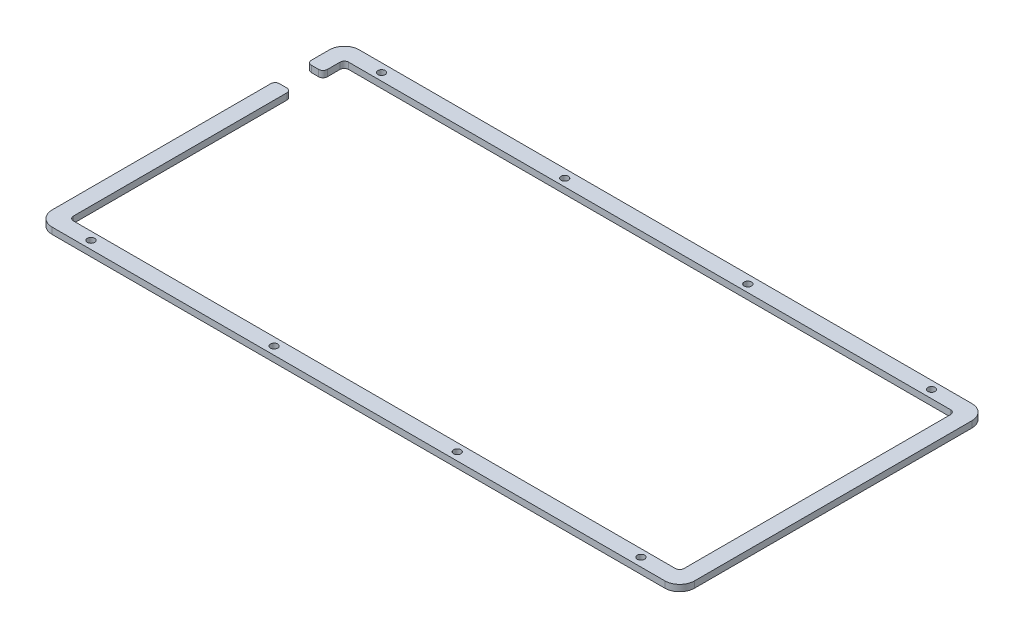
ISO-10303-21;
HEADER;
FILE_DESCRIPTION(('STEP AP214'),'2;1');
FILE_NAME('part.step','',(''),(''),'','','');
FILE_SCHEMA(('AUTOMOTIVE_DESIGN { 1 0 10303 214 1 1 1 1 }'));
ENDSEC;
DATA;
#1=APPLICATION_CONTEXT('core data for automotive mechanical design processes');
#2=APPLICATION_PROTOCOL_DEFINITION('international standard','automotive_design',2000,#1);
#3=PRODUCT_CONTEXT('',#1,'mechanical');
#4=PRODUCT('Part','Part','',(#3));
#5=PRODUCT_RELATED_PRODUCT_CATEGORY('part','',(#4));
#6=PRODUCT_DEFINITION_FORMATION('','',#4);
#7=PRODUCT_DEFINITION_CONTEXT('part definition',#1,'design');
#8=PRODUCT_DEFINITION('design','',#6,#7);
#9=PRODUCT_DEFINITION_SHAPE('','',#8);
#10=(LENGTH_UNIT() NAMED_UNIT(*) SI_UNIT(.MILLI.,.METRE.));
#11=(NAMED_UNIT(*) PLANE_ANGLE_UNIT() SI_UNIT($,.RADIAN.));
#12=(NAMED_UNIT(*) SI_UNIT($,.STERADIAN.) SOLID_ANGLE_UNIT());
#13=UNCERTAINTY_MEASURE_WITH_UNIT(LENGTH_MEASURE(1.E-05),#10,'distance_accuracy_value','');
#14=(GEOMETRIC_REPRESENTATION_CONTEXT(3) GLOBAL_UNCERTAINTY_ASSIGNED_CONTEXT((#13)) GLOBAL_UNIT_ASSIGNED_CONTEXT((#10,
#11,#12)) REPRESENTATION_CONTEXT('',''));
#15=CARTESIAN_POINT('',(0.,0.,0.));
#16=DIRECTION('',(0.,0.,1.));
#17=DIRECTION('',(1.,0.,0.));
#18=AXIS2_PLACEMENT_3D('',#15,#16,#17);
#19=CARTESIAN_POINT('',(0.,0.,0.));
#20=DIRECTION('',(0.,-1.,0.));
#21=DIRECTION('',(0.,0.,-1.));
#22=AXIS2_PLACEMENT_3D('',#19,#20,#21);
#23=PLANE('',#22);
#24=CARTESIAN_POINT('',(319.254485378789,0.,-162.946875699963));
#25=DIRECTION('',(0.,-1.,0.));
#26=DIRECTION('',(0.,0.,-1.));
#27=AXIS2_PLACEMENT_3D('',#24,#25,#26);
#28=CIRCLE('',#27,1.69999999999992);
#29=CARTESIAN_POINT('',(319.254485378789,0.,-164.646875699963));
#30=VERTEX_POINT('',#29);
#31=EDGE_CURVE('E43',#30,#30,#28,.T.);
#32=ORIENTED_EDGE('',*,*,#31,.F.);
#33=EDGE_LOOP('',(#32));
#34=FACE_BOUND('',#33,.T.);
#35=CARTESIAN_POINT('',(147.254485378789,0.,-26.2474156999631));
#36=DIRECTION('',(0.,-1.,0.));
#37=DIRECTION('',(0.,0.,-1.));
#38=AXIS2_PLACEMENT_3D('',#35,#36,#37);
#39=CIRCLE('',#38,1.70000000000001);
#40=CARTESIAN_POINT('',(147.254485378789,0.,-27.9474156999631));
#41=VERTEX_POINT('',#40);
#42=EDGE_CURVE('E436',#41,#41,#39,.T.);
#43=ORIENTED_EDGE('',*,*,#42,.F.);
#44=EDGE_LOOP('',(#43));
#45=FACE_BOUND('',#44,.T.);
#46=CARTESIAN_POINT('',(61.2544853787888,0.,-26.2474156999631));
#47=DIRECTION('',(0.,-1.,0.));
#48=DIRECTION('',(0.,0.,-1.));
#49=AXIS2_PLACEMENT_3D('',#46,#47,#48);
#50=CIRCLE('',#49,1.7);
#51=CARTESIAN_POINT('',(61.2544853787888,0.,-27.9474156999631));
#52=VERTEX_POINT('',#51);
#53=EDGE_CURVE('E434',#52,#52,#50,.T.);
#54=ORIENTED_EDGE('',*,*,#53,.F.);
#55=EDGE_LOOP('',(#54));
#56=FACE_BOUND('',#55,.T.);
#57=CARTESIAN_POINT('',(233.254485378789,0.,-26.2474156999631));
#58=DIRECTION('',(0.,-1.,0.));
#59=DIRECTION('',(0.,0.,-1.));
#60=AXIS2_PLACEMENT_3D('',#57,#58,#59);
#61=CIRCLE('',#60,1.70000000000001);
#62=CARTESIAN_POINT('',(233.254485378789,0.,-27.9474156999631));
#63=VERTEX_POINT('',#62);
#64=EDGE_CURVE('E431',#63,#63,#61,.T.);
#65=ORIENTED_EDGE('',*,*,#64,.F.);
#66=EDGE_LOOP('',(#65));
#67=FACE_BOUND('',#66,.T.);
#68=CARTESIAN_POINT('',(147.254485378789,0.,-162.696875699963));
#69=DIRECTION('',(0.,-1.,0.));
#70=DIRECTION('',(0.,0.,-1.));
#71=AXIS2_PLACEMENT_3D('',#68,#69,#70);
#72=CIRCLE('',#71,1.70000000000001);
#73=CARTESIAN_POINT('',(147.254485378789,0.,-164.396875699963));
#74=VERTEX_POINT('',#73);
#75=EDGE_CURVE('E363',#74,#74,#72,.T.);
#76=ORIENTED_EDGE('',*,*,#75,.F.);
#77=EDGE_LOOP('',(#76));
#78=FACE_BOUND('',#77,.T.);
#79=CARTESIAN_POINT('',(319.254485378789,0.,-26.4974156999631));
#80=DIRECTION('',(0.,-1.,0.));
#81=DIRECTION('',(0.,0.,-1.));
#82=AXIS2_PLACEMENT_3D('',#79,#80,#81);
#83=CIRCLE('',#82,1.69999999999992);
#84=CARTESIAN_POINT('',(319.254485378789,0.,-28.1974156999631));
#85=VERTEX_POINT('',#84);
#86=EDGE_CURVE('E354',#85,#85,#83,.T.);
#87=ORIENTED_EDGE('',*,*,#86,.F.);
#88=EDGE_LOOP('',(#87));
#89=FACE_BOUND('',#88,.T.);
#90=CARTESIAN_POINT('',(233.254485378789,0.,-162.696875699963));
#91=DIRECTION('',(0.,-1.,0.));
#92=DIRECTION('',(0.,0.,-1.));
#93=AXIS2_PLACEMENT_3D('',#90,#91,#92);
#94=CIRCLE('',#93,1.70000000000001);
#95=CARTESIAN_POINT('',(233.254485378789,0.,-164.396875699963));
#96=VERTEX_POINT('',#95);
#97=EDGE_CURVE('E357',#96,#96,#94,.T.);
#98=ORIENTED_EDGE('',*,*,#97,.F.);
#99=EDGE_LOOP('',(#98));
#100=FACE_BOUND('',#99,.T.);
#101=CARTESIAN_POINT('',(61.2544853787888,0.,-162.696875699963));
#102=DIRECTION('',(0.,-1.,0.));
#103=DIRECTION('',(0.,0.,-1.));
#104=AXIS2_PLACEMENT_3D('',#101,#102,#103);
#105=CIRCLE('',#104,1.7);
#106=CARTESIAN_POINT('',(61.2544853787888,0.,-164.396875699963));
#107=VERTEX_POINT('',#106);
#108=EDGE_CURVE('E360',#107,#107,#105,.T.);
#109=ORIENTED_EDGE('',*,*,#108,.F.);
#110=EDGE_LOOP('',(#109));
#111=FACE_BOUND('',#110,.T.);
#112=DIRECTION('',(0.,0.,-1.));
#113=VECTOR('',#112,1.);
#114=CARTESIAN_POINT('',(39.7544853787888,0.,0.));
#115=LINE('',#114,#113);
#116=CARTESIAN_POINT('',(39.7544853787888,0.,-151.196875699963));
#117=VERTEX_POINT('',#116);
#118=CARTESIAN_POINT('',(39.7544853787888,0.,-159.696875699963));
#119=VERTEX_POINT('',#118);
#120=EDGE_CURVE('E364',#117,#119,#115,.T.);
#121=ORIENTED_EDGE('',*,*,#120,.T.);
#122=CARTESIAN_POINT('',(46.7544853787888,0.,-159.696875699963));
#123=DIRECTION('',(0.,-1.,0.));
#124=DIRECTION('',(0.,0.,-1.));
#125=AXIS2_PLACEMENT_3D('',#122,#123,#124);
#126=CIRCLE('',#125,7.);
#127=CARTESIAN_POINT('',(46.7544853787888,0.,-166.696875699963));
#128=VERTEX_POINT('',#127);
#129=EDGE_CURVE('E12',#119,#128,#126,.T.);
#130=ORIENTED_EDGE('',*,*,#129,.T.);
#131=DIRECTION('',(1.,0.,0.));
#132=VECTOR('',#131,1.);
#133=CARTESIAN_POINT('',(0.,0.,-166.696875699963));
#134=LINE('',#133,#132);
#135=CARTESIAN_POINT('',(334.453835378789,0.,-166.696875699963));
#136=VERTEX_POINT('',#135);
#137=EDGE_CURVE('E48',#128,#136,#134,.T.);
#138=ORIENTED_EDGE('',*,*,#137,.T.);
#139=CARTESIAN_POINT('',(334.453835378789,0.,-159.696875699963));
#140=DIRECTION('',(0.,-1.,0.));
#141=DIRECTION('',(0.,0.,-1.));
#142=AXIS2_PLACEMENT_3D('',#139,#140,#141);
#143=CIRCLE('',#142,7.00000000000001);
#144=CARTESIAN_POINT('',(341.453835378789,0.,-159.696875699963));
#145=VERTEX_POINT('',#144);
#146=EDGE_CURVE('E424',#136,#145,#143,.T.);
#147=ORIENTED_EDGE('',*,*,#146,.T.);
#148=DIRECTION('',(0.,0.,1.));
#149=VECTOR('',#148,1.);
#150=CARTESIAN_POINT('',(341.453835378789,0.,0.));
#151=LINE('',#150,#149);
#152=CARTESIAN_POINT('',(341.453835378789,0.,-29.4974156999631));
#153=VERTEX_POINT('',#152);
#154=EDGE_CURVE('E421',#145,#153,#151,.T.);
#155=ORIENTED_EDGE('',*,*,#154,.T.);
#156=CARTESIAN_POINT('',(334.453835378789,0.,-29.4974156999631));
#157=DIRECTION('',(0.,-1.,0.));
#158=DIRECTION('',(0.,0.,-1.));
#159=AXIS2_PLACEMENT_3D('',#156,#157,#158);
#160=CIRCLE('',#159,7.);
#161=CARTESIAN_POINT('',(334.453835378789,0.,-22.4974156999631));
#162=VERTEX_POINT('',#161);
#163=EDGE_CURVE('E418',#153,#162,#160,.T.);
#164=ORIENTED_EDGE('',*,*,#163,.T.);
#165=DIRECTION('',(-1.,0.,0.));
#166=VECTOR('',#165,1.);
#167=CARTESIAN_POINT('',(0.,0.,-22.4974156999631));
#168=LINE('',#167,#166);
#169=CARTESIAN_POINT('',(46.7544853787888,0.,-22.4974156999631));
#170=VERTEX_POINT('',#169);
#171=EDGE_CURVE('E415',#162,#170,#168,.T.);
#172=ORIENTED_EDGE('',*,*,#171,.T.);
#173=CARTESIAN_POINT('',(46.7544853787888,0.,-29.4974156999631));
#174=DIRECTION('',(0.,-1.,0.));
#175=DIRECTION('',(0.,0.,-1.));
#176=AXIS2_PLACEMENT_3D('',#173,#174,#175);
#177=CIRCLE('',#176,7.);
#178=CARTESIAN_POINT('',(39.7544853787888,0.,-29.4974156999631));
#179=VERTEX_POINT('',#178);
#180=EDGE_CURVE('E412',#170,#179,#177,.T.);
#181=ORIENTED_EDGE('',*,*,#180,.T.);
#182=DIRECTION('',(0.,0.,-1.));
#183=VECTOR('',#182,1.);
#184=CARTESIAN_POINT('',(39.7544853787888,0.,0.));
#185=LINE('',#184,#183);
#186=CARTESIAN_POINT('',(39.7544853787888,0.,-132.196875699963));
#187=VERTEX_POINT('',#186);
#188=EDGE_CURVE('E409',#179,#187,#185,.T.);
#189=ORIENTED_EDGE('',*,*,#188,.T.);
#190=CARTESIAN_POINT('',(41.7544853787888,0.,-132.196875699963));
#191=DIRECTION('',(0.,-1.,0.));
#192=DIRECTION('',(0.,0.,-1.));
#193=AXIS2_PLACEMENT_3D('',#190,#191,#192);
#194=CIRCLE('',#193,2.);
#195=CARTESIAN_POINT('',(41.7544853787888,0.,-134.196875699963));
#196=VERTEX_POINT('',#195);
#197=EDGE_CURVE('E406',#187,#196,#194,.T.);
#198=ORIENTED_EDGE('',*,*,#197,.T.);
#199=DIRECTION('',(1.,0.,0.));
#200=VECTOR('',#199,1.);
#201=CARTESIAN_POINT('',(0.,0.,-134.196875699963));
#202=LINE('',#201,#200);
#203=CARTESIAN_POINT('',(45.2544853787888,0.,-134.196875699963));
#204=VERTEX_POINT('',#203);
#205=EDGE_CURVE('E403',#196,#204,#202,.T.);
#206=ORIENTED_EDGE('',*,*,#205,.T.);
#207=CARTESIAN_POINT('',(45.2544853787888,0.,-132.196875699963));
#208=DIRECTION('',(0.,-1.,0.));
#209=DIRECTION('',(0.,0.,-1.));
#210=AXIS2_PLACEMENT_3D('',#207,#208,#209);
#211=CIRCLE('',#210,2.);
#212=CARTESIAN_POINT('',(47.2544853787888,0.,-132.196875699963));
#213=VERTEX_POINT('',#212);
#214=EDGE_CURVE('E400',#204,#213,#211,.T.);
#215=ORIENTED_EDGE('',*,*,#214,.T.);
#216=DIRECTION('',(0.,0.,1.));
#217=VECTOR('',#216,1.);
#218=CARTESIAN_POINT('',(47.2544853787888,0.,0.));
#219=LINE('',#218,#217);
#220=CARTESIAN_POINT('',(47.2544853787888,0.,-31.9974156999631));
#221=VERTEX_POINT('',#220);
#222=EDGE_CURVE('E397',#213,#221,#219,.T.);
#223=ORIENTED_EDGE('',*,*,#222,.T.);
#224=CARTESIAN_POINT('',(49.2544853787888,0.,-31.9974156999631));
#225=DIRECTION('',(0.,-1.,0.));
#226=DIRECTION('',(0.,0.,-1.));
#227=AXIS2_PLACEMENT_3D('',#224,#225,#226);
#228=CIRCLE('',#227,2.);
#229=CARTESIAN_POINT('',(49.2544853787888,0.,-29.9974156999631));
#230=VERTEX_POINT('',#229);
#231=EDGE_CURVE('E394',#221,#230,#228,.F.);
#232=ORIENTED_EDGE('',*,*,#231,.T.);
#233=DIRECTION('',(1.,0.,0.));
#234=VECTOR('',#233,1.);
#235=CARTESIAN_POINT('',(0.,0.,-29.9974156999631));
#236=LINE('',#235,#234);
#237=CARTESIAN_POINT('',(331.953835378789,0.,-29.9974156999631));
#238=VERTEX_POINT('',#237);
#239=EDGE_CURVE('E391',#230,#238,#236,.T.);
#240=ORIENTED_EDGE('',*,*,#239,.T.);
#241=CARTESIAN_POINT('',(331.953835378789,0.,-31.9974156999631));
#242=DIRECTION('',(0.,-1.,0.));
#243=DIRECTION('',(0.,0.,-1.));
#244=AXIS2_PLACEMENT_3D('',#241,#242,#243);
#245=CIRCLE('',#244,2.);
#246=CARTESIAN_POINT('',(333.953835378789,0.,-31.9974156999631));
#247=VERTEX_POINT('',#246);
#248=EDGE_CURVE('E388',#238,#247,#245,.F.);
#249=ORIENTED_EDGE('',*,*,#248,.T.);
#250=DIRECTION('',(0.,0.,-1.));
#251=VECTOR('',#250,1.);
#252=CARTESIAN_POINT('',(333.953835378789,0.,0.));
#253=LINE('',#252,#251);
#254=CARTESIAN_POINT('',(333.953835378789,0.,-157.196875699963));
#255=VERTEX_POINT('',#254);
#256=EDGE_CURVE('E385',#247,#255,#253,.T.);
#257=ORIENTED_EDGE('',*,*,#256,.T.);
#258=CARTESIAN_POINT('',(331.953835378789,0.,-157.196875699963));
#259=DIRECTION('',(0.,-1.,0.));
#260=DIRECTION('',(0.,0.,-1.));
#261=AXIS2_PLACEMENT_3D('',#258,#259,#260);
#262=CIRCLE('',#261,2.);
#263=CARTESIAN_POINT('',(331.953835378789,0.,-159.196875699963));
#264=VERTEX_POINT('',#263);
#265=EDGE_CURVE('E382',#255,#264,#262,.F.);
#266=ORIENTED_EDGE('',*,*,#265,.T.);
#267=DIRECTION('',(-1.,0.,0.));
#268=VECTOR('',#267,1.);
#269=CARTESIAN_POINT('',(0.,0.,-159.196875699963));
#270=LINE('',#269,#268);
#271=CARTESIAN_POINT('',(49.2544853787888,0.,-159.196875699963));
#272=VERTEX_POINT('',#271);
#273=EDGE_CURVE('E379',#264,#272,#270,.T.);
#274=ORIENTED_EDGE('',*,*,#273,.T.);
#275=CARTESIAN_POINT('',(49.2544853787888,0.,-157.196875699963));
#276=DIRECTION('',(0.,-1.,0.));
#277=DIRECTION('',(0.,0.,-1.));
#278=AXIS2_PLACEMENT_3D('',#275,#276,#277);
#279=CIRCLE('',#278,2.);
#280=CARTESIAN_POINT('',(47.2544853787888,0.,-157.196875699963));
#281=VERTEX_POINT('',#280);
#282=EDGE_CURVE('E376',#272,#281,#279,.F.);
#283=ORIENTED_EDGE('',*,*,#282,.T.);
#284=DIRECTION('',(0.,0.,1.));
#285=VECTOR('',#284,1.);
#286=CARTESIAN_POINT('',(47.2544853787888,0.,0.));
#287=LINE('',#286,#285);
#288=CARTESIAN_POINT('',(47.2544853787888,0.,-151.196875699963));
#289=VERTEX_POINT('',#288);
#290=EDGE_CURVE('E373',#281,#289,#287,.T.);
#291=ORIENTED_EDGE('',*,*,#290,.T.);
#292=CARTESIAN_POINT('',(45.2544853787888,0.,-151.196875699963));
#293=DIRECTION('',(0.,-1.,0.));
#294=DIRECTION('',(0.,0.,-1.));
#295=AXIS2_PLACEMENT_3D('',#292,#293,#294);
#296=CIRCLE('',#295,2.);
#297=CARTESIAN_POINT('',(45.2544853787888,0.,-149.196875699963));
#298=VERTEX_POINT('',#297);
#299=EDGE_CURVE('E370',#289,#298,#296,.T.);
#300=ORIENTED_EDGE('',*,*,#299,.T.);
#301=DIRECTION('',(-1.,0.,0.));
#302=VECTOR('',#301,1.);
#303=CARTESIAN_POINT('',(0.,0.,-149.196875699963));
#304=LINE('',#303,#302);
#305=CARTESIAN_POINT('',(41.7544853787888,0.,-149.196875699963));
#306=VERTEX_POINT('',#305);
#307=EDGE_CURVE('E368',#298,#306,#304,.T.);
#308=ORIENTED_EDGE('',*,*,#307,.T.);
#309=CARTESIAN_POINT('',(41.7544853787888,0.,-151.196875699963));
#310=DIRECTION('',(0.,-1.,0.));
#311=DIRECTION('',(0.,0.,-1.));
#312=AXIS2_PLACEMENT_3D('',#309,#310,#311);
#313=CIRCLE('',#312,2.);
#314=EDGE_CURVE('E205',#306,#117,#313,.T.);
#315=ORIENTED_EDGE('',*,*,#314,.T.);
#316=EDGE_LOOP('',(#121,#130,#138,#147,#155,#164,#172,#181,#189,#198,#206,#215,#223,#232,#240,
#249,#257,#266,#274,#283,#291,#300,#308,#315));
#317=FACE_BOUND('',#316,.T.);
#318=ADVANCED_FACE('F40',(#34,#45,#56,#67,#78,#89,#100,#111,#317),#23,.T.);
#319=CARTESIAN_POINT('',(319.254485378789,-7.,-26.4974156999631));
#320=DIRECTION('',(0.,1.,0.));
#321=DIRECTION('',(0.,0.,1.));
#322=AXIS2_PLACEMENT_3D('',#319,#320,#321);
#323=CYLINDRICAL_SURFACE('',#322,1.69999999999992);
#324=ORIENTED_EDGE('',*,*,#86,.T.);
#325=EDGE_LOOP('',(#324));
#326=FACE_BOUND('',#325,.T.);
#327=CARTESIAN_POINT('',(319.254485378789,3.,-26.4974156999631));
#328=DIRECTION('',(0.,1.,0.));
#329=DIRECTION('',(0.,0.,1.));
#330=AXIS2_PLACEMENT_3D('',#327,#328,#329);
#331=CIRCLE('',#330,1.69999999999992);
#332=CARTESIAN_POINT('',(319.254485378789,3.,-24.7974156999632));
#333=VERTEX_POINT('',#332);
#334=EDGE_CURVE('E349',#333,#333,#331,.T.);
#335=ORIENTED_EDGE('',*,*,#334,.T.);
#336=EDGE_LOOP('',(#335));
#337=FACE_BOUND('',#336,.T.);
#338=ADVANCED_FACE('F448',(#326,#337),#323,.F.);
#339=CARTESIAN_POINT('',(233.254485378789,-7.,-162.696875699963));
#340=DIRECTION('',(0.,1.,0.));
#341=DIRECTION('',(0.,0.,1.));
#342=AXIS2_PLACEMENT_3D('',#339,#340,#341);
#343=CYLINDRICAL_SURFACE('',#342,1.70000000000001);
#344=ORIENTED_EDGE('',*,*,#97,.T.);
#345=EDGE_LOOP('',(#344));
#346=FACE_BOUND('',#345,.T.);
#347=CARTESIAN_POINT('',(233.254485378789,3.,-162.696875699963));
#348=DIRECTION('',(0.,1.,0.));
#349=DIRECTION('',(0.,0.,1.));
#350=AXIS2_PLACEMENT_3D('',#347,#348,#349);
#351=CIRCLE('',#350,1.70000000000001);
#352=CARTESIAN_POINT('',(233.254485378789,3.,-160.996875699963));
#353=VERTEX_POINT('',#352);
#354=EDGE_CURVE('E334',#353,#353,#351,.T.);
#355=ORIENTED_EDGE('',*,*,#354,.T.);
#356=EDGE_LOOP('',(#355));
#357=FACE_BOUND('',#356,.T.);
#358=ADVANCED_FACE('F567',(#346,#357),#343,.F.);
#359=CARTESIAN_POINT('',(61.2544853787888,-7.,-162.696875699963));
#360=DIRECTION('',(0.,1.,0.));
#361=DIRECTION('',(0.,0.,1.));
#362=AXIS2_PLACEMENT_3D('',#359,#360,#361);
#363=CYLINDRICAL_SURFACE('',#362,1.7);
#364=ORIENTED_EDGE('',*,*,#108,.T.);
#365=EDGE_LOOP('',(#364));
#366=FACE_BOUND('',#365,.T.);
#367=CARTESIAN_POINT('',(61.2544853787888,3.,-162.696875699963));
#368=DIRECTION('',(0.,1.,0.));
#369=DIRECTION('',(0.,0.,1.));
#370=AXIS2_PLACEMENT_3D('',#367,#368,#369);
#371=CIRCLE('',#370,1.7);
#372=CARTESIAN_POINT('',(61.2544853787888,3.,-160.996875699963));
#373=VERTEX_POINT('',#372);
#374=EDGE_CURVE('E333',#373,#373,#371,.T.);
#375=ORIENTED_EDGE('',*,*,#374,.T.);
#376=EDGE_LOOP('',(#375));
#377=FACE_BOUND('',#376,.T.);
#378=ADVANCED_FACE('F562',(#366,#377),#363,.F.);
#379=CARTESIAN_POINT('',(46.7544853787888,-7.,-159.696875699963));
#380=DIRECTION('',(0.,1.,0.));
#381=DIRECTION('',(0.,0.,1.));
#382=AXIS2_PLACEMENT_3D('',#379,#380,#381);
#383=CYLINDRICAL_SURFACE('',#382,7.);
#384=DIRECTION('',(0.,1.,0.));
#385=VECTOR('',#384,1.);
#386=CARTESIAN_POINT('',(39.7544853787888,-7.,-159.696875699963));
#387=LINE('',#386,#385);
#388=CARTESIAN_POINT('',(39.7544853787888,3.,-159.696875699963));
#389=VERTEX_POINT('',#388);
#390=EDGE_CURVE('E64',#119,#389,#387,.T.);
#391=ORIENTED_EDGE('',*,*,#390,.T.);
#392=CARTESIAN_POINT('',(46.7544853787888,3.,-159.696875699963));
#393=DIRECTION('',(0.,1.,0.));
#394=DIRECTION('',(0.,0.,1.));
#395=AXIS2_PLACEMENT_3D('',#392,#393,#394);
#396=CIRCLE('',#395,7.);
#397=CARTESIAN_POINT('',(46.7544853787888,3.,-166.696875699963));
#398=VERTEX_POINT('',#397);
#399=EDGE_CURVE('E225',#398,#389,#396,.T.);
#400=ORIENTED_EDGE('',*,*,#399,.F.);
#401=DIRECTION('',(0.,1.,0.));
#402=VECTOR('',#401,1.);
#403=CARTESIAN_POINT('',(46.7544853787888,-7.,-166.696875699963));
#404=LINE('',#403,#402);
#405=EDGE_CURVE('E287',#128,#398,#404,.T.);
#406=ORIENTED_EDGE('',*,*,#405,.F.);
#407=ORIENTED_EDGE('',*,*,#129,.F.);
#408=EDGE_LOOP('',(#391,#400,#406,#407));
#409=FACE_BOUND('',#408,.T.);
#410=ADVANCED_FACE('F467',(#409),#383,.T.);
#411=CARTESIAN_POINT('',(46.7544853787888,-7.,-166.696875699963));
#412=DIRECTION('',(0.,0.,-1.));
#413=DIRECTION('',(-1.,0.,0.));
#414=AXIS2_PLACEMENT_3D('',#411,#412,#413);
#415=PLANE('',#414);
#416=ORIENTED_EDGE('',*,*,#405,.T.);
#417=DIRECTION('',(-1.,0.,0.));
#418=VECTOR('',#417,1.);
#419=CARTESIAN_POINT('',(46.7544853787888,3.,-166.696875699963));
#420=LINE('',#419,#418);
#421=CARTESIAN_POINT('',(334.453835378789,3.,-166.696875699963));
#422=VERTEX_POINT('',#421);
#423=EDGE_CURVE('E284',#422,#398,#420,.T.);
#424=ORIENTED_EDGE('',*,*,#423,.F.);
#425=DIRECTION('',(0.,1.,0.));
#426=VECTOR('',#425,1.);
#427=CARTESIAN_POINT('',(334.453835378789,-7.,-166.696875699963));
#428=LINE('',#427,#426);
#429=EDGE_CURVE('E290',#136,#422,#428,.T.);
#430=ORIENTED_EDGE('',*,*,#429,.F.);
#431=ORIENTED_EDGE('',*,*,#137,.F.);
#432=EDGE_LOOP('',(#416,#424,#430,#431));
#433=FACE_BOUND('',#432,.T.);
#434=ADVANCED_FACE('F469',(#433),#415,.T.);
#435=CARTESIAN_POINT('',(334.453835378789,-7.,-159.696875699963));
#436=DIRECTION('',(0.,1.,0.));
#437=DIRECTION('',(0.,0.,1.));
#438=AXIS2_PLACEMENT_3D('',#435,#436,#437);
#439=CYLINDRICAL_SURFACE('',#438,7.00000000000001);
#440=ORIENTED_EDGE('',*,*,#429,.T.);
#441=CARTESIAN_POINT('',(334.453835378789,3.,-159.696875699963));
#442=DIRECTION('',(0.,1.,0.));
#443=DIRECTION('',(0.,0.,1.));
#444=AXIS2_PLACEMENT_3D('',#441,#442,#443);
#445=CIRCLE('',#444,7.00000000000001);
#446=CARTESIAN_POINT('',(341.453835378789,3.,-159.696875699963));
#447=VERTEX_POINT('',#446);
#448=EDGE_CURVE('E281',#447,#422,#445,.T.);
#449=ORIENTED_EDGE('',*,*,#448,.F.);
#450=DIRECTION('',(0.,1.,0.));
#451=VECTOR('',#450,1.);
#452=CARTESIAN_POINT('',(341.453835378789,-7.,-159.696875699963));
#453=LINE('',#452,#451);
#454=EDGE_CURVE('E292',#145,#447,#453,.T.);
#455=ORIENTED_EDGE('',*,*,#454,.F.);
#456=ORIENTED_EDGE('',*,*,#146,.F.);
#457=EDGE_LOOP('',(#440,#449,#455,#456));
#458=FACE_BOUND('',#457,.T.);
#459=ADVANCED_FACE('F473',(#458),#439,.T.);
#460=CARTESIAN_POINT('',(341.453835378789,-7.,-159.696875699963));
#461=DIRECTION('',(1.,0.,0.));
#462=DIRECTION('',(0.,0.,-1.));
#463=AXIS2_PLACEMENT_3D('',#460,#461,#462);
#464=PLANE('',#463);
#465=ORIENTED_EDGE('',*,*,#454,.T.);
#466=DIRECTION('',(0.,0.,-1.));
#467=VECTOR('',#466,1.);
#468=CARTESIAN_POINT('',(341.453835378789,3.,-159.696875699963));
#469=LINE('',#468,#467);
#470=CARTESIAN_POINT('',(341.453835378789,3.,-29.4974156999631));
#471=VERTEX_POINT('',#470);
#472=EDGE_CURVE('E278',#471,#447,#469,.T.);
#473=ORIENTED_EDGE('',*,*,#472,.F.);
#474=DIRECTION('',(0.,1.,0.));
#475=VECTOR('',#474,1.);
#476=CARTESIAN_POINT('',(341.453835378789,-7.,-29.4974156999631));
#477=LINE('',#476,#475);
#478=EDGE_CURVE('E294',#153,#471,#477,.T.);
#479=ORIENTED_EDGE('',*,*,#478,.F.);
#480=ORIENTED_EDGE('',*,*,#154,.F.);
#481=EDGE_LOOP('',(#465,#473,#479,#480));
#482=FACE_BOUND('',#481,.T.);
#483=ADVANCED_FACE('F477',(#482),#464,.T.);
#484=CARTESIAN_POINT('',(334.453835378789,-7.,-29.4974156999631));
#485=DIRECTION('',(0.,1.,0.));
#486=DIRECTION('',(0.,0.,1.));
#487=AXIS2_PLACEMENT_3D('',#484,#485,#486);
#488=CYLINDRICAL_SURFACE('',#487,7.);
#489=ORIENTED_EDGE('',*,*,#478,.T.);
#490=CARTESIAN_POINT('',(334.453835378789,3.,-29.4974156999631));
#491=DIRECTION('',(0.,1.,0.));
#492=DIRECTION('',(0.,0.,1.));
#493=AXIS2_PLACEMENT_3D('',#490,#491,#492);
#494=CIRCLE('',#493,7.);
#495=CARTESIAN_POINT('',(334.453835378789,3.,-22.4974156999631));
#496=VERTEX_POINT('',#495);
#497=EDGE_CURVE('E275',#496,#471,#494,.T.);
#498=ORIENTED_EDGE('',*,*,#497,.F.);
#499=DIRECTION('',(0.,1.,0.));
#500=VECTOR('',#499,1.);
#501=CARTESIAN_POINT('',(334.453835378789,-7.,-22.4974156999631));
#502=LINE('',#501,#500);
#503=EDGE_CURVE('E296',#162,#496,#502,.T.);
#504=ORIENTED_EDGE('',*,*,#503,.F.);
#505=ORIENTED_EDGE('',*,*,#163,.F.);
#506=EDGE_LOOP('',(#489,#498,#504,#505));
#507=FACE_BOUND('',#506,.T.);
#508=ADVANCED_FACE('F481',(#507),#488,.T.);
#509=CARTESIAN_POINT('',(334.453835378789,-7.,-22.4974156999631));
#510=DIRECTION('',(0.,0.,1.));
#511=DIRECTION('',(1.,0.,0.));
#512=AXIS2_PLACEMENT_3D('',#509,#510,#511);
#513=PLANE('',#512);
#514=ORIENTED_EDGE('',*,*,#503,.T.);
#515=DIRECTION('',(1.,0.,0.));
#516=VECTOR('',#515,1.);
#517=CARTESIAN_POINT('',(334.453835378789,3.,-22.4974156999631));
#518=LINE('',#517,#516);
#519=CARTESIAN_POINT('',(46.7544853787888,3.,-22.4974156999631));
#520=VERTEX_POINT('',#519);
#521=EDGE_CURVE('E272',#520,#496,#518,.T.);
#522=ORIENTED_EDGE('',*,*,#521,.F.);
#523=DIRECTION('',(0.,1.,0.));
#524=VECTOR('',#523,1.);
#525=CARTESIAN_POINT('',(46.7544853787888,-7.,-22.4974156999631));
#526=LINE('',#525,#524);
#527=EDGE_CURVE('E298',#170,#520,#526,.T.);
#528=ORIENTED_EDGE('',*,*,#527,.F.);
#529=ORIENTED_EDGE('',*,*,#171,.F.);
#530=EDGE_LOOP('',(#514,#522,#528,#529));
#531=FACE_BOUND('',#530,.T.);
#532=ADVANCED_FACE('F485',(#531),#513,.T.);
#533=CARTESIAN_POINT('',(46.7544853787888,-7.,-29.4974156999631));
#534=DIRECTION('',(0.,1.,0.));
#535=DIRECTION('',(0.,0.,1.));
#536=AXIS2_PLACEMENT_3D('',#533,#534,#535);
#537=CYLINDRICAL_SURFACE('',#536,7.);
#538=ORIENTED_EDGE('',*,*,#527,.T.);
#539=CARTESIAN_POINT('',(46.7544853787888,3.,-29.4974156999631));
#540=DIRECTION('',(0.,1.,0.));
#541=DIRECTION('',(0.,0.,1.));
#542=AXIS2_PLACEMENT_3D('',#539,#540,#541);
#543=CIRCLE('',#542,7.);
#544=CARTESIAN_POINT('',(39.7544853787888,3.,-29.4974156999631));
#545=VERTEX_POINT('',#544);
#546=EDGE_CURVE('E269',#545,#520,#543,.T.);
#547=ORIENTED_EDGE('',*,*,#546,.F.);
#548=DIRECTION('',(0.,1.,0.));
#549=VECTOR('',#548,1.);
#550=CARTESIAN_POINT('',(39.7544853787888,-7.,-29.4974156999631));
#551=LINE('',#550,#549);
#552=EDGE_CURVE('E300',#179,#545,#551,.T.);
#553=ORIENTED_EDGE('',*,*,#552,.F.);
#554=ORIENTED_EDGE('',*,*,#180,.F.);
#555=EDGE_LOOP('',(#538,#547,#553,#554));
#556=FACE_BOUND('',#555,.T.);
#557=ADVANCED_FACE('F489',(#556),#537,.T.);
#558=CARTESIAN_POINT('',(39.7544853787888,-7.,-132.196875699963));
#559=DIRECTION('',(-1.,0.,0.));
#560=DIRECTION('',(0.,0.,1.));
#561=AXIS2_PLACEMENT_3D('',#558,#559,#560);
#562=PLANE('',#561);
#563=ORIENTED_EDGE('',*,*,#552,.T.);
#564=DIRECTION('',(0.,0.,1.));
#565=VECTOR('',#564,1.);
#566=CARTESIAN_POINT('',(39.7544853787888,3.,-132.196875699963));
#567=LINE('',#566,#565);
#568=CARTESIAN_POINT('',(39.7544853787888,3.,-132.196875699963));
#569=VERTEX_POINT('',#568);
#570=EDGE_CURVE('E266',#569,#545,#567,.T.);
#571=ORIENTED_EDGE('',*,*,#570,.F.);
#572=DIRECTION('',(0.,1.,0.));
#573=VECTOR('',#572,1.);
#574=CARTESIAN_POINT('',(39.7544853787888,-7.,-132.196875699963));
#575=LINE('',#574,#573);
#576=EDGE_CURVE('E302',#187,#569,#575,.T.);
#577=ORIENTED_EDGE('',*,*,#576,.F.);
#578=ORIENTED_EDGE('',*,*,#188,.F.);
#579=EDGE_LOOP('',(#563,#571,#577,#578));
#580=FACE_BOUND('',#579,.T.);
#581=ADVANCED_FACE('F493',(#580),#562,.T.);
#582=CARTESIAN_POINT('',(41.7544853787888,-7.,-132.196875699963));
#583=DIRECTION('',(0.,1.,0.));
#584=DIRECTION('',(0.,0.,1.));
#585=AXIS2_PLACEMENT_3D('',#582,#583,#584);
#586=CYLINDRICAL_SURFACE('',#585,2.);
#587=ORIENTED_EDGE('',*,*,#576,.T.);
#588=CARTESIAN_POINT('',(41.7544853787888,3.,-132.196875699963));
#589=DIRECTION('',(0.,1.,0.));
#590=DIRECTION('',(0.,0.,1.));
#591=AXIS2_PLACEMENT_3D('',#588,#589,#590);
#592=CIRCLE('',#591,2.);
#593=CARTESIAN_POINT('',(41.7544853787888,3.,-134.196875699963));
#594=VERTEX_POINT('',#593);
#595=EDGE_CURVE('E263',#594,#569,#592,.T.);
#596=ORIENTED_EDGE('',*,*,#595,.F.);
#597=DIRECTION('',(0.,1.,0.));
#598=VECTOR('',#597,1.);
#599=CARTESIAN_POINT('',(41.7544853787888,-7.,-134.196875699963));
#600=LINE('',#599,#598);
#601=EDGE_CURVE('E304',#196,#594,#600,.T.);
#602=ORIENTED_EDGE('',*,*,#601,.F.);
#603=ORIENTED_EDGE('',*,*,#197,.F.);
#604=EDGE_LOOP('',(#587,#596,#602,#603));
#605=FACE_BOUND('',#604,.T.);
#606=ADVANCED_FACE('F497',(#605),#586,.T.);
#607=CARTESIAN_POINT('',(45.2544853787888,-7.,-134.196875699963));
#608=DIRECTION('',(0.,0.,-1.));
#609=DIRECTION('',(-1.,0.,0.));
#610=AXIS2_PLACEMENT_3D('',#607,#608,#609);
#611=PLANE('',#610);
#612=ORIENTED_EDGE('',*,*,#601,.T.);
#613=DIRECTION('',(-1.,0.,0.));
#614=VECTOR('',#613,1.);
#615=CARTESIAN_POINT('',(45.2544853787888,3.,-134.196875699963));
#616=LINE('',#615,#614);
#617=CARTESIAN_POINT('',(45.2544853787888,3.,-134.196875699963));
#618=VERTEX_POINT('',#617);
#619=EDGE_CURVE('E260',#618,#594,#616,.T.);
#620=ORIENTED_EDGE('',*,*,#619,.F.);
#621=DIRECTION('',(0.,1.,0.));
#622=VECTOR('',#621,1.);
#623=CARTESIAN_POINT('',(45.2544853787888,-7.,-134.196875699963));
#624=LINE('',#623,#622);
#625=EDGE_CURVE('E306',#204,#618,#624,.T.);
#626=ORIENTED_EDGE('',*,*,#625,.F.);
#627=ORIENTED_EDGE('',*,*,#205,.F.);
#628=EDGE_LOOP('',(#612,#620,#626,#627));
#629=FACE_BOUND('',#628,.T.);
#630=ADVANCED_FACE('F501',(#629),#611,.T.);
#631=CARTESIAN_POINT('',(45.2544853787888,-7.,-132.196875699963));
#632=DIRECTION('',(0.,1.,0.));
#633=DIRECTION('',(0.,0.,1.));
#634=AXIS2_PLACEMENT_3D('',#631,#632,#633);
#635=CYLINDRICAL_SURFACE('',#634,2.);
#636=ORIENTED_EDGE('',*,*,#625,.T.);
#637=CARTESIAN_POINT('',(45.2544853787888,3.,-132.196875699963));
#638=DIRECTION('',(0.,1.,0.));
#639=DIRECTION('',(0.,0.,1.));
#640=AXIS2_PLACEMENT_3D('',#637,#638,#639);
#641=CIRCLE('',#640,2.);
#642=CARTESIAN_POINT('',(47.2544853787888,3.,-132.196875699963));
#643=VERTEX_POINT('',#642);
#644=EDGE_CURVE('E257',#643,#618,#641,.T.);
#645=ORIENTED_EDGE('',*,*,#644,.F.);
#646=DIRECTION('',(0.,1.,0.));
#647=VECTOR('',#646,1.);
#648=CARTESIAN_POINT('',(47.2544853787888,-7.,-132.196875699963));
#649=LINE('',#648,#647);
#650=EDGE_CURVE('E308',#213,#643,#649,.T.);
#651=ORIENTED_EDGE('',*,*,#650,.F.);
#652=ORIENTED_EDGE('',*,*,#214,.F.);
#653=EDGE_LOOP('',(#636,#645,#651,#652));
#654=FACE_BOUND('',#653,.T.);
#655=ADVANCED_FACE('F505',(#654),#635,.T.);
#656=CARTESIAN_POINT('',(47.2544853787888,-7.,-132.196875699963));
#657=DIRECTION('',(1.,0.,0.));
#658=DIRECTION('',(0.,0.,-1.));
#659=AXIS2_PLACEMENT_3D('',#656,#657,#658);
#660=PLANE('',#659);
#661=ORIENTED_EDGE('',*,*,#650,.T.);
#662=DIRECTION('',(0.,0.,-1.));
#663=VECTOR('',#662,1.);
#664=CARTESIAN_POINT('',(47.2544853787888,3.,-132.196875699963));
#665=LINE('',#664,#663);
#666=CARTESIAN_POINT('',(47.2544853787888,3.,-31.9974156999631));
#667=VERTEX_POINT('',#666);
#668=EDGE_CURVE('E254',#667,#643,#665,.T.);
#669=ORIENTED_EDGE('',*,*,#668,.F.);
#670=DIRECTION('',(0.,1.,0.));
#671=VECTOR('',#670,1.);
#672=CARTESIAN_POINT('',(47.2544853787888,-7.,-31.9974156999631));
#673=LINE('',#672,#671);
#674=EDGE_CURVE('E310',#221,#667,#673,.T.);
#675=ORIENTED_EDGE('',*,*,#674,.F.);
#676=ORIENTED_EDGE('',*,*,#222,.F.);
#677=EDGE_LOOP('',(#661,#669,#675,#676));
#678=FACE_BOUND('',#677,.T.);
#679=ADVANCED_FACE('F509',(#678),#660,.T.);
#680=CARTESIAN_POINT('',(49.2544853787888,-7.,-31.9974156999631));
#681=DIRECTION('',(0.,1.,0.));
#682=DIRECTION('',(0.,0.,1.));
#683=AXIS2_PLACEMENT_3D('',#680,#681,#682);
#684=CYLINDRICAL_SURFACE('',#683,2.);
#685=ORIENTED_EDGE('',*,*,#674,.T.);
#686=CARTESIAN_POINT('',(49.2544853787888,3.,-31.9974156999631));
#687=DIRECTION('',(0.,-1.,0.));
#688=DIRECTION('',(0.,0.,1.));
#689=AXIS2_PLACEMENT_3D('',#686,#687,#688);
#690=CIRCLE('',#689,2.);
#691=CARTESIAN_POINT('',(49.2544853787888,3.,-29.9974156999631));
#692=VERTEX_POINT('',#691);
#693=EDGE_CURVE('E251',#692,#667,#690,.T.);
#694=ORIENTED_EDGE('',*,*,#693,.F.);
#695=DIRECTION('',(0.,1.,0.));
#696=VECTOR('',#695,1.);
#697=CARTESIAN_POINT('',(49.2544853787888,-7.,-29.9974156999631));
#698=LINE('',#697,#696);
#699=EDGE_CURVE('E312',#230,#692,#698,.T.);
#700=ORIENTED_EDGE('',*,*,#699,.F.);
#701=ORIENTED_EDGE('',*,*,#231,.F.);
#702=EDGE_LOOP('',(#685,#694,#700,#701));
#703=FACE_BOUND('',#702,.T.);
#704=ADVANCED_FACE('F513',(#703),#684,.F.);
#705=CARTESIAN_POINT('',(331.953835378789,-7.,-29.9974156999631));
#706=DIRECTION('',(0.,0.,-1.));
#707=DIRECTION('',(-1.,0.,0.));
#708=AXIS2_PLACEMENT_3D('',#705,#706,#707);
#709=PLANE('',#708);
#710=ORIENTED_EDGE('',*,*,#699,.T.);
#711=DIRECTION('',(-1.,0.,0.));
#712=VECTOR('',#711,1.);
#713=CARTESIAN_POINT('',(331.953835378789,3.,-29.9974156999631));
#714=LINE('',#713,#712);
#715=CARTESIAN_POINT('',(331.953835378789,3.,-29.9974156999631));
#716=VERTEX_POINT('',#715);
#717=EDGE_CURVE('E248',#716,#692,#714,.T.);
#718=ORIENTED_EDGE('',*,*,#717,.F.);
#719=DIRECTION('',(0.,1.,0.));
#720=VECTOR('',#719,1.);
#721=CARTESIAN_POINT('',(331.953835378789,-7.,-29.9974156999631));
#722=LINE('',#721,#720);
#723=EDGE_CURVE('E314',#238,#716,#722,.T.);
#724=ORIENTED_EDGE('',*,*,#723,.F.);
#725=ORIENTED_EDGE('',*,*,#239,.F.);
#726=EDGE_LOOP('',(#710,#718,#724,#725));
#727=FACE_BOUND('',#726,.T.);
#728=ADVANCED_FACE('F517',(#727),#709,.T.);
#729=CARTESIAN_POINT('',(331.953835378789,-7.,-31.9974156999631));
#730=DIRECTION('',(0.,1.,0.));
#731=DIRECTION('',(0.,0.,1.));
#732=AXIS2_PLACEMENT_3D('',#729,#730,#731);
#733=CYLINDRICAL_SURFACE('',#732,2.);
#734=ORIENTED_EDGE('',*,*,#723,.T.);
#735=CARTESIAN_POINT('',(331.953835378789,3.,-31.9974156999631));
#736=DIRECTION('',(0.,-1.,0.));
#737=DIRECTION('',(0.,0.,1.));
#738=AXIS2_PLACEMENT_3D('',#735,#736,#737);
#739=CIRCLE('',#738,2.);
#740=CARTESIAN_POINT('',(333.953835378789,3.,-31.9974156999631));
#741=VERTEX_POINT('',#740);
#742=EDGE_CURVE('E245',#741,#716,#739,.T.);
#743=ORIENTED_EDGE('',*,*,#742,.F.);
#744=DIRECTION('',(0.,1.,0.));
#745=VECTOR('',#744,1.);
#746=CARTESIAN_POINT('',(333.953835378789,-7.,-31.9974156999631));
#747=LINE('',#746,#745);
#748=EDGE_CURVE('E316',#247,#741,#747,.T.);
#749=ORIENTED_EDGE('',*,*,#748,.F.);
#750=ORIENTED_EDGE('',*,*,#248,.F.);
#751=EDGE_LOOP('',(#734,#743,#749,#750));
#752=FACE_BOUND('',#751,.T.);
#753=ADVANCED_FACE('F521',(#752),#733,.F.);
#754=CARTESIAN_POINT('',(333.953835378789,-7.,-31.9974156999631));
#755=DIRECTION('',(-1.,0.,0.));
#756=DIRECTION('',(0.,0.,1.));
#757=AXIS2_PLACEMENT_3D('',#754,#755,#756);
#758=PLANE('',#757);
#759=ORIENTED_EDGE('',*,*,#748,.T.);
#760=DIRECTION('',(0.,0.,1.));
#761=VECTOR('',#760,1.);
#762=CARTESIAN_POINT('',(333.953835378789,3.,-31.9974156999631));
#763=LINE('',#762,#761);
#764=CARTESIAN_POINT('',(333.953835378789,3.,-157.196875699963));
#765=VERTEX_POINT('',#764);
#766=EDGE_CURVE('E242',#765,#741,#763,.T.);
#767=ORIENTED_EDGE('',*,*,#766,.F.);
#768=DIRECTION('',(0.,1.,0.));
#769=VECTOR('',#768,1.);
#770=CARTESIAN_POINT('',(333.953835378789,-7.,-157.196875699963));
#771=LINE('',#770,#769);
#772=EDGE_CURVE('E318',#255,#765,#771,.T.);
#773=ORIENTED_EDGE('',*,*,#772,.F.);
#774=ORIENTED_EDGE('',*,*,#256,.F.);
#775=EDGE_LOOP('',(#759,#767,#773,#774));
#776=FACE_BOUND('',#775,.T.);
#777=ADVANCED_FACE('F525',(#776),#758,.T.);
#778=CARTESIAN_POINT('',(331.953835378789,-7.,-157.196875699963));
#779=DIRECTION('',(0.,1.,0.));
#780=DIRECTION('',(0.,0.,1.));
#781=AXIS2_PLACEMENT_3D('',#778,#779,#780);
#782=CYLINDRICAL_SURFACE('',#781,2.);
#783=ORIENTED_EDGE('',*,*,#772,.T.);
#784=CARTESIAN_POINT('',(331.953835378789,3.,-157.196875699963));
#785=DIRECTION('',(0.,-1.,0.));
#786=DIRECTION('',(0.,0.,1.));
#787=AXIS2_PLACEMENT_3D('',#784,#785,#786);
#788=CIRCLE('',#787,2.);
#789=CARTESIAN_POINT('',(331.953835378789,3.,-159.196875699963));
#790=VERTEX_POINT('',#789);
#791=EDGE_CURVE('E239',#790,#765,#788,.T.);
#792=ORIENTED_EDGE('',*,*,#791,.F.);
#793=DIRECTION('',(0.,1.,0.));
#794=VECTOR('',#793,1.);
#795=CARTESIAN_POINT('',(331.953835378789,-7.,-159.196875699963));
#796=LINE('',#795,#794);
#797=EDGE_CURVE('E320',#264,#790,#796,.T.);
#798=ORIENTED_EDGE('',*,*,#797,.F.);
#799=ORIENTED_EDGE('',*,*,#265,.F.);
#800=EDGE_LOOP('',(#783,#792,#798,#799));
#801=FACE_BOUND('',#800,.T.);
#802=ADVANCED_FACE('F529',(#801),#782,.F.);
#803=CARTESIAN_POINT('',(49.2544853787888,-7.,-159.196875699963));
#804=DIRECTION('',(0.,0.,1.));
#805=DIRECTION('',(1.,0.,0.));
#806=AXIS2_PLACEMENT_3D('',#803,#804,#805);
#807=PLANE('',#806);
#808=ORIENTED_EDGE('',*,*,#797,.T.);
#809=DIRECTION('',(1.,0.,0.));
#810=VECTOR('',#809,1.);
#811=CARTESIAN_POINT('',(49.2544853787888,3.,-159.196875699963));
#812=LINE('',#811,#810);
#813=CARTESIAN_POINT('',(49.2544853787888,3.,-159.196875699963));
#814=VERTEX_POINT('',#813);
#815=EDGE_CURVE('E236',#814,#790,#812,.T.);
#816=ORIENTED_EDGE('',*,*,#815,.F.);
#817=DIRECTION('',(0.,1.,0.));
#818=VECTOR('',#817,1.);
#819=CARTESIAN_POINT('',(49.2544853787888,-7.,-159.196875699963));
#820=LINE('',#819,#818);
#821=EDGE_CURVE('E322',#272,#814,#820,.T.);
#822=ORIENTED_EDGE('',*,*,#821,.F.);
#823=ORIENTED_EDGE('',*,*,#273,.F.);
#824=EDGE_LOOP('',(#808,#816,#822,#823));
#825=FACE_BOUND('',#824,.T.);
#826=ADVANCED_FACE('F533',(#825),#807,.T.);
#827=CARTESIAN_POINT('',(49.2544853787888,-7.,-157.196875699963));
#828=DIRECTION('',(0.,1.,0.));
#829=DIRECTION('',(0.,0.,1.));
#830=AXIS2_PLACEMENT_3D('',#827,#828,#829);
#831=CYLINDRICAL_SURFACE('',#830,2.);
#832=ORIENTED_EDGE('',*,*,#821,.T.);
#833=CARTESIAN_POINT('',(49.2544853787888,3.,-157.196875699963));
#834=DIRECTION('',(0.,-1.,0.));
#835=DIRECTION('',(0.,0.,1.));
#836=AXIS2_PLACEMENT_3D('',#833,#834,#835);
#837=CIRCLE('',#836,2.);
#838=CARTESIAN_POINT('',(47.2544853787888,3.,-157.196875699963));
#839=VERTEX_POINT('',#838);
#840=EDGE_CURVE('E233',#839,#814,#837,.T.);
#841=ORIENTED_EDGE('',*,*,#840,.F.);
#842=DIRECTION('',(0.,1.,0.));
#843=VECTOR('',#842,1.);
#844=CARTESIAN_POINT('',(47.2544853787888,-7.,-157.196875699963));
#845=LINE('',#844,#843);
#846=EDGE_CURVE('E324',#281,#839,#845,.T.);
#847=ORIENTED_EDGE('',*,*,#846,.F.);
#848=ORIENTED_EDGE('',*,*,#282,.F.);
#849=EDGE_LOOP('',(#832,#841,#847,#848));
#850=FACE_BOUND('',#849,.T.);
#851=ADVANCED_FACE('F537',(#850),#831,.F.);
#852=CARTESIAN_POINT('',(47.2544853787888,-7.,-157.196875699963));
#853=DIRECTION('',(1.,0.,0.));
#854=DIRECTION('',(0.,0.,-1.));
#855=AXIS2_PLACEMENT_3D('',#852,#853,#854);
#856=PLANE('',#855);
#857=ORIENTED_EDGE('',*,*,#846,.T.);
#858=DIRECTION('',(0.,0.,-1.));
#859=VECTOR('',#858,1.);
#860=CARTESIAN_POINT('',(47.2544853787888,3.,-157.196875699963));
#861=LINE('',#860,#859);
#862=CARTESIAN_POINT('',(47.2544853787888,3.,-151.196875699963));
#863=VERTEX_POINT('',#862);
#864=EDGE_CURVE('E230',#863,#839,#861,.T.);
#865=ORIENTED_EDGE('',*,*,#864,.F.);
#866=DIRECTION('',(0.,1.,0.));
#867=VECTOR('',#866,1.);
#868=CARTESIAN_POINT('',(47.2544853787888,-7.,-151.196875699963));
#869=LINE('',#868,#867);
#870=EDGE_CURVE('E326',#289,#863,#869,.T.);
#871=ORIENTED_EDGE('',*,*,#870,.F.);
#872=ORIENTED_EDGE('',*,*,#290,.F.);
#873=EDGE_LOOP('',(#857,#865,#871,#872));
#874=FACE_BOUND('',#873,.T.);
#875=ADVANCED_FACE('F541',(#874),#856,.T.);
#876=CARTESIAN_POINT('',(45.2544853787888,-7.,-151.196875699963));
#877=DIRECTION('',(0.,1.,0.));
#878=DIRECTION('',(0.,0.,1.));
#879=AXIS2_PLACEMENT_3D('',#876,#877,#878);
#880=CYLINDRICAL_SURFACE('',#879,2.);
#881=ORIENTED_EDGE('',*,*,#870,.T.);
#882=CARTESIAN_POINT('',(45.2544853787888,3.,-151.196875699963));
#883=DIRECTION('',(0.,1.,0.));
#884=DIRECTION('',(0.,0.,1.));
#885=AXIS2_PLACEMENT_3D('',#882,#883,#884);
#886=CIRCLE('',#885,2.);
#887=CARTESIAN_POINT('',(45.2544853787888,3.,-149.196875699963));
#888=VERTEX_POINT('',#887);
#889=EDGE_CURVE('E218',#888,#863,#886,.T.);
#890=ORIENTED_EDGE('',*,*,#889,.F.);
#891=DIRECTION('',(0.,1.,0.));
#892=VECTOR('',#891,1.);
#893=CARTESIAN_POINT('',(45.2544853787888,-7.,-149.196875699963));
#894=LINE('',#893,#892);
#895=EDGE_CURVE('E208',#298,#888,#894,.T.);
#896=ORIENTED_EDGE('',*,*,#895,.F.);
#897=ORIENTED_EDGE('',*,*,#299,.F.);
#898=EDGE_LOOP('',(#881,#890,#896,#897));
#899=FACE_BOUND('',#898,.T.);
#900=ADVANCED_FACE('F544',(#899),#880,.T.);
#901=CARTESIAN_POINT('',(41.7544853787888,-7.,-149.196875699963));
#902=DIRECTION('',(0.,0.,1.));
#903=DIRECTION('',(1.,0.,0.));
#904=AXIS2_PLACEMENT_3D('',#901,#902,#903);
#905=PLANE('',#904);
#906=ORIENTED_EDGE('',*,*,#895,.T.);
#907=DIRECTION('',(1.,0.,0.));
#908=VECTOR('',#907,1.);
#909=CARTESIAN_POINT('',(41.7544853787888,3.,-149.196875699963));
#910=LINE('',#909,#908);
#911=CARTESIAN_POINT('',(41.7544853787888,3.,-149.196875699963));
#912=VERTEX_POINT('',#911);
#913=EDGE_CURVE('E212',#912,#888,#910,.T.);
#914=ORIENTED_EDGE('',*,*,#913,.F.);
#915=DIRECTION('',(0.,1.,0.));
#916=VECTOR('',#915,1.);
#917=CARTESIAN_POINT('',(41.7544853787888,-7.,-149.196875699963));
#918=LINE('',#917,#916);
#919=EDGE_CURVE('E201',#306,#912,#918,.T.);
#920=ORIENTED_EDGE('',*,*,#919,.F.);
#921=ORIENTED_EDGE('',*,*,#307,.F.);
#922=EDGE_LOOP('',(#906,#914,#920,#921));
#923=FACE_BOUND('',#922,.T.);
#924=ADVANCED_FACE('F213',(#923),#905,.T.);
#925=CARTESIAN_POINT('',(41.7544853787888,-7.,-151.196875699963));
#926=DIRECTION('',(0.,1.,0.));
#927=DIRECTION('',(0.,0.,1.));
#928=AXIS2_PLACEMENT_3D('',#925,#926,#927);
#929=CYLINDRICAL_SURFACE('',#928,2.);
#930=ORIENTED_EDGE('',*,*,#919,.T.);
#931=CARTESIAN_POINT('',(41.7544853787888,3.,-151.196875699963));
#932=DIRECTION('',(0.,1.,0.));
#933=DIRECTION('',(0.,0.,1.));
#934=AXIS2_PLACEMENT_3D('',#931,#932,#933);
#935=CIRCLE('',#934,2.);
#936=CARTESIAN_POINT('',(39.7544853787888,3.,-151.196875699963));
#937=VERTEX_POINT('',#936);
#938=EDGE_CURVE('E56',#937,#912,#935,.T.);
#939=ORIENTED_EDGE('',*,*,#938,.F.);
#940=DIRECTION('',(0.,1.,0.));
#941=VECTOR('',#940,1.);
#942=CARTESIAN_POINT('',(39.7544853787888,-7.,-151.196875699963));
#943=LINE('',#942,#941);
#944=EDGE_CURVE('E209',#117,#937,#943,.T.);
#945=ORIENTED_EDGE('',*,*,#944,.F.);
#946=ORIENTED_EDGE('',*,*,#314,.F.);
#947=EDGE_LOOP('',(#930,#939,#945,#946));
#948=FACE_BOUND('',#947,.T.);
#949=ADVANCED_FACE('F203',(#948),#929,.T.);
#950=CARTESIAN_POINT('',(39.7544853787888,-7.,-151.196875699963));
#951=DIRECTION('',(-1.,0.,0.));
#952=DIRECTION('',(0.,0.,1.));
#953=AXIS2_PLACEMENT_3D('',#950,#951,#952);
#954=PLANE('',#953);
#955=ORIENTED_EDGE('',*,*,#944,.T.);
#956=DIRECTION('',(0.,0.,1.));
#957=VECTOR('',#956,1.);
#958=CARTESIAN_POINT('',(39.7544853787888,3.,-151.196875699963));
#959=LINE('',#958,#957);
#960=EDGE_CURVE('E223',#389,#937,#959,.T.);
#961=ORIENTED_EDGE('',*,*,#960,.F.);
#962=ORIENTED_EDGE('',*,*,#390,.F.);
#963=ORIENTED_EDGE('',*,*,#120,.F.);
#964=EDGE_LOOP('',(#955,#961,#962,#963));
#965=FACE_BOUND('',#964,.T.);
#966=ADVANCED_FACE('F462',(#965),#954,.T.);
#967=CARTESIAN_POINT('',(147.254485378789,-7.,-162.696875699963));
#968=DIRECTION('',(0.,1.,0.));
#969=DIRECTION('',(0.,0.,1.));
#970=AXIS2_PLACEMENT_3D('',#967,#968,#969);
#971=CYLINDRICAL_SURFACE('',#970,1.70000000000001);
#972=ORIENTED_EDGE('',*,*,#75,.T.);
#973=EDGE_LOOP('',(#972));
#974=FACE_BOUND('',#973,.T.);
#975=CARTESIAN_POINT('',(147.254485378789,3.,-162.696875699963));
#976=DIRECTION('',(0.,1.,0.));
#977=DIRECTION('',(0.,0.,1.));
#978=AXIS2_PLACEMENT_3D('',#975,#976,#977);
#979=CIRCLE('',#978,1.70000000000001);
#980=CARTESIAN_POINT('',(147.254485378789,3.,-160.996875699963));
#981=VERTEX_POINT('',#980);
#982=EDGE_CURVE('E289',#981,#981,#979,.T.);
#983=ORIENTED_EDGE('',*,*,#982,.T.);
#984=EDGE_LOOP('',(#983));
#985=FACE_BOUND('',#984,.T.);
#986=ADVANCED_FACE('F559',(#974,#985),#971,.F.);
#987=CARTESIAN_POINT('',(233.254485378789,-7.,-26.2474156999631));
#988=DIRECTION('',(0.,1.,0.));
#989=DIRECTION('',(0.,0.,1.));
#990=AXIS2_PLACEMENT_3D('',#987,#988,#989);
#991=CYLINDRICAL_SURFACE('',#990,1.70000000000001);
#992=ORIENTED_EDGE('',*,*,#64,.T.);
#993=EDGE_LOOP('',(#992));
#994=FACE_BOUND('',#993,.T.);
#995=CARTESIAN_POINT('',(233.254485378789,3.,-26.2474156999631));
#996=DIRECTION('',(0.,1.,0.));
#997=DIRECTION('',(0.,0.,1.));
#998=AXIS2_PLACEMENT_3D('',#995,#996,#997);
#999=CIRCLE('',#998,1.70000000000001);
#1000=CARTESIAN_POINT('',(233.254485378789,3.,-24.5474156999631));
#1001=VERTEX_POINT('',#1000);
#1002=EDGE_CURVE('E346',#1001,#1001,#999,.T.);
#1003=ORIENTED_EDGE('',*,*,#1002,.T.);
#1004=EDGE_LOOP('',(#1003));
#1005=FACE_BOUND('',#1004,.T.);
#1006=ADVANCED_FACE('F565',(#994,#1005),#991,.F.);
#1007=CARTESIAN_POINT('',(61.2544853787888,-7.,-26.2474156999631));
#1008=DIRECTION('',(0.,1.,0.));
#1009=DIRECTION('',(0.,0.,1.));
#1010=AXIS2_PLACEMENT_3D('',#1007,#1008,#1009);
#1011=CYLINDRICAL_SURFACE('',#1010,1.7);
#1012=ORIENTED_EDGE('',*,*,#53,.T.);
#1013=EDGE_LOOP('',(#1012));
#1014=FACE_BOUND('',#1013,.T.);
#1015=CARTESIAN_POINT('',(61.2544853787888,3.,-26.2474156999631));
#1016=DIRECTION('',(0.,1.,0.));
#1017=DIRECTION('',(0.,0.,1.));
#1018=AXIS2_PLACEMENT_3D('',#1015,#1016,#1017);
#1019=CIRCLE('',#1018,1.7);
#1020=CARTESIAN_POINT('',(61.2544853787888,3.,-24.5474156999631));
#1021=VERTEX_POINT('',#1020);
#1022=EDGE_CURVE('E343',#1021,#1021,#1019,.T.);
#1023=ORIENTED_EDGE('',*,*,#1022,.T.);
#1024=EDGE_LOOP('',(#1023));
#1025=FACE_BOUND('',#1024,.T.);
#1026=ADVANCED_FACE('F577',(#1014,#1025),#1011,.F.);
#1027=CARTESIAN_POINT('',(147.254485378789,-7.,-26.2474156999631));
#1028=DIRECTION('',(0.,1.,0.));
#1029=DIRECTION('',(0.,0.,1.));
#1030=AXIS2_PLACEMENT_3D('',#1027,#1028,#1029);
#1031=CYLINDRICAL_SURFACE('',#1030,1.70000000000001);
#1032=ORIENTED_EDGE('',*,*,#42,.T.);
#1033=EDGE_LOOP('',(#1032));
#1034=FACE_BOUND('',#1033,.T.);
#1035=CARTESIAN_POINT('',(147.254485378789,3.,-26.2474156999631));
#1036=DIRECTION('',(0.,1.,0.));
#1037=DIRECTION('',(0.,0.,1.));
#1038=AXIS2_PLACEMENT_3D('',#1035,#1036,#1037);
#1039=CIRCLE('',#1038,1.70000000000001);
#1040=CARTESIAN_POINT('',(147.254485378789,3.,-24.5474156999631));
#1041=VERTEX_POINT('',#1040);
#1042=EDGE_CURVE('E340',#1041,#1041,#1039,.T.);
#1043=ORIENTED_EDGE('',*,*,#1042,.T.);
#1044=EDGE_LOOP('',(#1043));
#1045=FACE_BOUND('',#1044,.T.);
#1046=ADVANCED_FACE('F574',(#1034,#1045),#1031,.F.);
#1047=CARTESIAN_POINT('',(319.254485378789,-7.,-162.946875699963));
#1048=DIRECTION('',(0.,1.,0.));
#1049=DIRECTION('',(0.,0.,1.));
#1050=AXIS2_PLACEMENT_3D('',#1047,#1048,#1049);
#1051=CYLINDRICAL_SURFACE('',#1050,1.69999999999992);
#1052=ORIENTED_EDGE('',*,*,#31,.T.);
#1053=EDGE_LOOP('',(#1052));
#1054=FACE_BOUND('',#1053,.T.);
#1055=CARTESIAN_POINT('',(319.254485378789,3.,-162.946875699963));
#1056=DIRECTION('',(0.,1.,0.));
#1057=DIRECTION('',(0.,0.,1.));
#1058=AXIS2_PLACEMENT_3D('',#1055,#1056,#1057);
#1059=CIRCLE('',#1058,1.69999999999992);
#1060=CARTESIAN_POINT('',(319.254485378789,3.,-161.246875699963));
#1061=VERTEX_POINT('',#1060);
#1062=EDGE_CURVE('E337',#1061,#1061,#1059,.T.);
#1063=ORIENTED_EDGE('',*,*,#1062,.T.);
#1064=EDGE_LOOP('',(#1063));
#1065=FACE_BOUND('',#1064,.T.);
#1066=ADVANCED_FACE('F443',(#1054,#1065),#1051,.F.);
#1067=CARTESIAN_POINT('',(0.,3.,0.));
#1068=DIRECTION('',(0.,-1.,0.));
#1069=DIRECTION('',(0.,0.,-1.));
#1070=AXIS2_PLACEMENT_3D('',#1067,#1068,#1069);
#1071=PLANE('',#1070);
#1072=ORIENTED_EDGE('',*,*,#1062,.F.);
#1073=EDGE_LOOP('',(#1072));
#1074=FACE_BOUND('',#1073,.T.);
#1075=ORIENTED_EDGE('',*,*,#1042,.F.);
#1076=EDGE_LOOP('',(#1075));
#1077=FACE_BOUND('',#1076,.T.);
#1078=ORIENTED_EDGE('',*,*,#1022,.F.);
#1079=EDGE_LOOP('',(#1078));
#1080=FACE_BOUND('',#1079,.T.);
#1081=ORIENTED_EDGE('',*,*,#1002,.F.);
#1082=EDGE_LOOP('',(#1081));
#1083=FACE_BOUND('',#1082,.T.);
#1084=ORIENTED_EDGE('',*,*,#982,.F.);
#1085=EDGE_LOOP('',(#1084));
#1086=FACE_BOUND('',#1085,.T.);
#1087=ORIENTED_EDGE('',*,*,#334,.F.);
#1088=EDGE_LOOP('',(#1087));
#1089=FACE_BOUND('',#1088,.T.);
#1090=ORIENTED_EDGE('',*,*,#354,.F.);
#1091=EDGE_LOOP('',(#1090));
#1092=FACE_BOUND('',#1091,.T.);
#1093=ORIENTED_EDGE('',*,*,#374,.F.);
#1094=EDGE_LOOP('',(#1093));
#1095=FACE_BOUND('',#1094,.T.);
#1096=ORIENTED_EDGE('',*,*,#399,.T.);
#1097=ORIENTED_EDGE('',*,*,#960,.T.);
#1098=ORIENTED_EDGE('',*,*,#938,.T.);
#1099=ORIENTED_EDGE('',*,*,#913,.T.);
#1100=ORIENTED_EDGE('',*,*,#889,.T.);
#1101=ORIENTED_EDGE('',*,*,#864,.T.);
#1102=ORIENTED_EDGE('',*,*,#840,.T.);
#1103=ORIENTED_EDGE('',*,*,#815,.T.);
#1104=ORIENTED_EDGE('',*,*,#791,.T.);
#1105=ORIENTED_EDGE('',*,*,#766,.T.);
#1106=ORIENTED_EDGE('',*,*,#742,.T.);
#1107=ORIENTED_EDGE('',*,*,#717,.T.);
#1108=ORIENTED_EDGE('',*,*,#693,.T.);
#1109=ORIENTED_EDGE('',*,*,#668,.T.);
#1110=ORIENTED_EDGE('',*,*,#644,.T.);
#1111=ORIENTED_EDGE('',*,*,#619,.T.);
#1112=ORIENTED_EDGE('',*,*,#595,.T.);
#1113=ORIENTED_EDGE('',*,*,#570,.T.);
#1114=ORIENTED_EDGE('',*,*,#546,.T.);
#1115=ORIENTED_EDGE('',*,*,#521,.T.);
#1116=ORIENTED_EDGE('',*,*,#497,.T.);
#1117=ORIENTED_EDGE('',*,*,#472,.T.);
#1118=ORIENTED_EDGE('',*,*,#448,.T.);
#1119=ORIENTED_EDGE('',*,*,#423,.T.);
#1120=EDGE_LOOP('',(#1096,#1097,#1098,#1099,#1100,#1101,#1102,#1103,#1104,#1105,#1106,#1107,
#1108,#1109,#1110,#1111,#1112,#1113,#1114,#1115,#1116,#1117,#1118,#1119));
#1121=FACE_BOUND('',#1120,.T.);
#1122=ADVANCED_FACE('F222',(#1074,#1077,#1080,#1083,#1086,#1089,#1092,#1095,#1121),#1071,.F.);
#1123=CLOSED_SHELL('',(#318,#338,#358,#378,#410,#434,#459,#483,#508,#532,#557,#581,#606,#630,
#655,#679,#704,#728,#753,#777,#802,#826,#851,#875,#900,#924,#949,#966,#986,#1006,#1026,#1046,
#1066,#1122));
#1124=MANIFOLD_SOLID_BREP('B2',#1123);
#1125=ADVANCED_BREP_SHAPE_REPRESENTATION('',(#18,#1124),#14);
#1126=SHAPE_DEFINITION_REPRESENTATION(#9,#1125);
ENDSEC;
END-ISO-10303-21;
